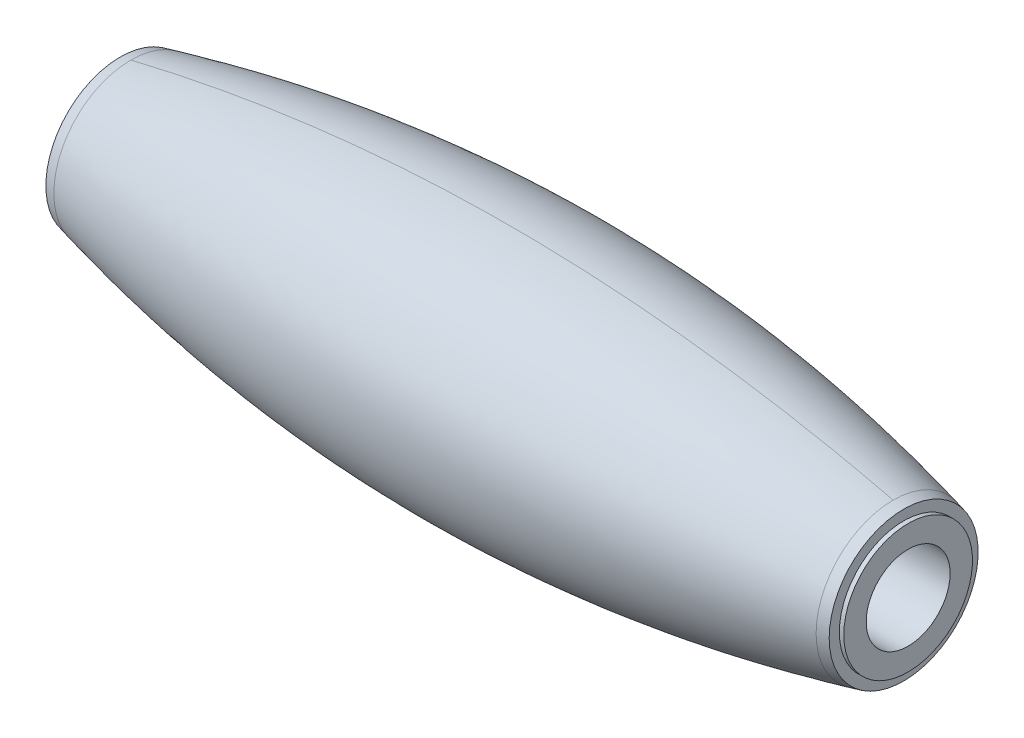
ISO-10303-21;
HEADER;
FILE_DESCRIPTION(('STEP AP214'),'2;1');
FILE_NAME('part.step','',(''),(''),'','','');
FILE_SCHEMA(('AUTOMOTIVE_DESIGN { 1 0 10303 214 1 1 1 1 }'));
ENDSEC;
DATA;
#1=APPLICATION_CONTEXT('core data for automotive mechanical design processes');
#2=APPLICATION_PROTOCOL_DEFINITION('international standard','automotive_design',2000,#1);
#3=PRODUCT_CONTEXT('',#1,'mechanical');
#4=PRODUCT('Part','Part','',(#3));
#5=PRODUCT_RELATED_PRODUCT_CATEGORY('part','',(#4));
#6=PRODUCT_DEFINITION_FORMATION('','',#4);
#7=PRODUCT_DEFINITION_CONTEXT('part definition',#1,'design');
#8=PRODUCT_DEFINITION('design','',#6,#7);
#9=PRODUCT_DEFINITION_SHAPE('','',#8);
#10=(LENGTH_UNIT() NAMED_UNIT(*) SI_UNIT(.MILLI.,.METRE.));
#11=(NAMED_UNIT(*) PLANE_ANGLE_UNIT() SI_UNIT($,.RADIAN.));
#12=(NAMED_UNIT(*) SI_UNIT($,.STERADIAN.) SOLID_ANGLE_UNIT());
#13=UNCERTAINTY_MEASURE_WITH_UNIT(LENGTH_MEASURE(1.E-05),#10,'distance_accuracy_value','');
#14=(GEOMETRIC_REPRESENTATION_CONTEXT(3) GLOBAL_UNCERTAINTY_ASSIGNED_CONTEXT((#13)) GLOBAL_UNIT_ASSIGNED_CONTEXT((#10,
#11,#12)) REPRESENTATION_CONTEXT('',''));
#15=CARTESIAN_POINT('',(0.,0.,0.));
#16=DIRECTION('',(0.,0.,1.));
#17=DIRECTION('',(1.,0.,0.));
#18=AXIS2_PLACEMENT_3D('',#15,#16,#17);
#19=CARTESIAN_POINT('',(0.,0.,0.));
#20=DIRECTION('',(1.,0.,0.));
#21=DIRECTION('',(0.,0.,-1.));
#22=AXIS2_PLACEMENT_3D('',#19,#20,#21);
#23=CYLINDRICAL_SURFACE('',#22,2.38125);
#24=CARTESIAN_POINT('',(22.479,0.,0.));
#25=DIRECTION('',(1.,0.,0.));
#26=DIRECTION('',(0.,0.,-1.));
#27=AXIS2_PLACEMENT_3D('',#24,#25,#26);
#28=CIRCLE('',#27,2.38125);
#29=CARTESIAN_POINT('',(22.479,0.,-2.38125));
#30=VERTEX_POINT('',#29);
#31=EDGE_CURVE('E86',#30,#30,#28,.F.);
#32=ORIENTED_EDGE('',*,*,#31,.F.);
#33=EDGE_LOOP('',(#32));
#34=FACE_BOUND('',#33,.T.);
#35=CARTESIAN_POINT('',(-22.4790000000034,0.,0.));
#36=DIRECTION('',(1.,0.,0.));
#37=DIRECTION('',(0.,0.,-1.));
#38=AXIS2_PLACEMENT_3D('',#35,#36,#37);
#39=CIRCLE('',#38,2.38125);
#40=CARTESIAN_POINT('',(-22.4790000000034,0.,-2.38125));
#41=VERTEX_POINT('',#40);
#42=EDGE_CURVE('E20',#41,#41,#39,.T.);
#43=ORIENTED_EDGE('',*,*,#42,.F.);
#44=EDGE_LOOP('',(#43));
#45=FACE_BOUND('',#44,.T.);
#46=ADVANCED_FACE('F17',(#34,#45),#23,.F.);
#47=CARTESIAN_POINT('',(-22.4790000000034,0.,0.));
#48=DIRECTION('',(-1.,0.,0.));
#49=DIRECTION('',(0.,0.,1.));
#50=AXIS2_PLACEMENT_3D('',#47,#48,#49);
#51=PLANE('',#50);
#52=ORIENTED_EDGE('',*,*,#42,.T.);
#53=EDGE_LOOP('',(#52));
#54=FACE_BOUND('',#53,.T.);
#55=CARTESIAN_POINT('',(-22.4790000000034,0.,0.));
#56=DIRECTION('',(1.,0.,0.));
#57=DIRECTION('',(0.,0.,-1.));
#58=AXIS2_PLACEMENT_3D('',#55,#56,#57);
#59=CIRCLE('',#58,3.65125);
#60=CARTESIAN_POINT('',(-22.4790000000034,0.,-3.65125));
#61=VERTEX_POINT('',#60);
#62=EDGE_CURVE('E84',#61,#61,#59,.T.);
#63=ORIENTED_EDGE('',*,*,#62,.F.);
#64=EDGE_LOOP('',(#63));
#65=FACE_BOUND('',#64,.T.);
#66=ADVANCED_FACE('F93',(#54,#65),#51,.T.);
#67=CARTESIAN_POINT('',(22.479,0.,0.));
#68=DIRECTION('',(1.,0.,0.));
#69=DIRECTION('',(0.,0.,-1.));
#70=AXIS2_PLACEMENT_3D('',#67,#68,#69);
#71=PLANE('',#70);
#72=ORIENTED_EDGE('',*,*,#31,.T.);
#73=EDGE_LOOP('',(#72));
#74=FACE_BOUND('',#73,.T.);
#75=CARTESIAN_POINT('',(22.479,0.,0.));
#76=DIRECTION('',(-1.,0.,0.));
#77=DIRECTION('',(0.,0.,1.));
#78=AXIS2_PLACEMENT_3D('',#75,#76,#77);
#79=CIRCLE('',#78,3.65125);
#80=CARTESIAN_POINT('',(22.479,0.,3.65125));
#81=VERTEX_POINT('',#80);
#82=EDGE_CURVE('E81',#81,#81,#79,.T.);
#83=ORIENTED_EDGE('',*,*,#82,.F.);
#84=EDGE_LOOP('',(#83));
#85=FACE_BOUND('',#84,.T.);
#86=ADVANCED_FACE('F102',(#74,#85),#71,.T.);
#87=CARTESIAN_POINT('',(-22.4790000000034,0.,0.));
#88=DIRECTION('',(1.,0.,0.));
#89=DIRECTION('',(0.,0.,-1.));
#90=AXIS2_PLACEMENT_3D('',#87,#88,#89);
#91=CYLINDRICAL_SURFACE('',#90,3.65125);
#92=CARTESIAN_POINT('',(-22.2250000000034,0.,0.));
#93=DIRECTION('',(1.,0.,0.));
#94=DIRECTION('',(0.,0.,-1.));
#95=AXIS2_PLACEMENT_3D('',#92,#93,#94);
#96=CIRCLE('',#95,3.65125);
#97=CARTESIAN_POINT('',(-22.2250000000034,0.,-3.65125));
#98=VERTEX_POINT('',#97);
#99=EDGE_CURVE('E78',#98,#98,#96,.T.);
#100=ORIENTED_EDGE('',*,*,#99,.F.);
#101=EDGE_LOOP('',(#100));
#102=FACE_BOUND('',#101,.T.);
#103=ORIENTED_EDGE('',*,*,#62,.T.);
#104=EDGE_LOOP('',(#103));
#105=FACE_BOUND('',#104,.T.);
#106=ADVANCED_FACE('F141',(#102,#105),#91,.T.);
#107=CARTESIAN_POINT('',(22.479,0.,0.));
#108=DIRECTION('',(-1.,0.,0.));
#109=DIRECTION('',(0.,0.,1.));
#110=AXIS2_PLACEMENT_3D('',#107,#108,#109);
#111=CYLINDRICAL_SURFACE('',#110,3.65125);
#112=CARTESIAN_POINT('',(22.225,0.,0.));
#113=DIRECTION('',(-1.,0.,0.));
#114=DIRECTION('',(0.,0.,1.));
#115=AXIS2_PLACEMENT_3D('',#112,#113,#114);
#116=CIRCLE('',#115,3.65125);
#117=CARTESIAN_POINT('',(22.225,0.,3.65125));
#118=VERTEX_POINT('',#117);
#119=EDGE_CURVE('E75',#118,#118,#116,.T.);
#120=ORIENTED_EDGE('',*,*,#119,.F.);
#121=EDGE_LOOP('',(#120));
#122=FACE_BOUND('',#121,.T.);
#123=ORIENTED_EDGE('',*,*,#82,.T.);
#124=EDGE_LOOP('',(#123));
#125=FACE_BOUND('',#124,.T.);
#126=ADVANCED_FACE('F137',(#122,#125),#111,.T.);
#127=CARTESIAN_POINT('',(-22.2250000000034,2.38125,0.));
#128=DIRECTION('',(-1.,0.,0.));
#129=DIRECTION('',(0.,0.,1.));
#130=AXIS2_PLACEMENT_3D('',#127,#128,#129);
#131=PLANE('',#130);
#132=ORIENTED_EDGE('',*,*,#99,.T.);
#133=EDGE_LOOP('',(#132));
#134=FACE_BOUND('',#133,.T.);
#135=CARTESIAN_POINT('',(-22.2249999999917,0.,0.));
#136=DIRECTION('',(1.,0.,0.));
#137=DIRECTION('',(0.,0.,-1.));
#138=AXIS2_PLACEMENT_3D('',#135,#136,#137);
#139=CIRCLE('',#138,4.22655856244964);
#140=CARTESIAN_POINT('',(-22.2249999999917,0.,-4.22655856244964));
#141=VERTEX_POINT('',#140);
#142=EDGE_CURVE('E72',#141,#141,#139,.T.);
#143=ORIENTED_EDGE('',*,*,#142,.F.);
#144=EDGE_LOOP('',(#143));
#145=FACE_BOUND('',#144,.T.);
#146=ADVANCED_FACE('F133',(#134,#145),#131,.T.);
#147=CARTESIAN_POINT('',(22.225,2.38125,0.));
#148=DIRECTION('',(1.,0.,0.));
#149=DIRECTION('',(0.,0.,-1.));
#150=AXIS2_PLACEMENT_3D('',#147,#148,#149);
#151=PLANE('',#150);
#152=ORIENTED_EDGE('',*,*,#119,.T.);
#153=EDGE_LOOP('',(#152));
#154=FACE_BOUND('',#153,.T.);
#155=CARTESIAN_POINT('',(22.2250000000486,0.,0.));
#156=DIRECTION('',(-1.,0.,0.));
#157=DIRECTION('',(0.,0.,1.));
#158=AXIS2_PLACEMENT_3D('',#155,#156,#157);
#159=CIRCLE('',#158,4.22655856246385);
#160=CARTESIAN_POINT('',(22.2250000000486,0.,4.22655856246385));
#161=VERTEX_POINT('',#160);
#162=EDGE_CURVE('E48',#161,#161,#159,.T.);
#163=ORIENTED_EDGE('',*,*,#162,.F.);
#164=EDGE_LOOP('',(#163));
#165=FACE_BOUND('',#164,.T.);
#166=ADVANCED_FACE('F129',(#154,#165),#151,.T.);
#167=CARTESIAN_POINT('',(-21.6280284818708,0.,0.));
#168=DIRECTION('',(1.,0.,0.));
#169=DIRECTION('',(0.,0.,-1.));
#170=AXIS2_PLACEMENT_3D('',#167,#168,#169);
#171=CONICAL_SURFACE('',#170,4.37090708773269,0.237247536257771);
#172=ORIENTED_EDGE('',*,*,#142,.T.);
#173=EDGE_LOOP('',(#172));
#174=FACE_BOUND('',#173,.T.);
#175=CARTESIAN_POINT('',(-21.6280284816593,0.,0.));
#176=DIRECTION('',(1.,0.,0.));
#177=DIRECTION('',(0.,0.,-1.));
#178=AXIS2_PLACEMENT_3D('',#175,#176,#177);
#179=CIRCLE('',#178,4.37090708779612);
#180=CARTESIAN_POINT('',(-21.6280284818708,-4.37090708773269,0.));
#181=VERTEX_POINT('',#180);
#182=CARTESIAN_POINT('',(-21.6280284816901,4.37090708779118,0.));
#183=VERTEX_POINT('',#182);
#184=EDGE_CURVE('E55',#181,#183,#179,.T.);
#185=ORIENTED_EDGE('',*,*,#184,.F.);
#186=CARTESIAN_POINT('',(-21.6280284816593,0.,0.));
#187=DIRECTION('',(1.,0.,0.));
#188=DIRECTION('',(0.,0.,-1.));
#189=AXIS2_PLACEMENT_3D('',#186,#187,#188);
#190=CIRCLE('',#189,4.37090708779612);
#191=EDGE_CURVE('E41',#183,#181,#190,.T.);
#192=ORIENTED_EDGE('',*,*,#191,.F.);
#193=EDGE_LOOP('',(#185,#192));
#194=FACE_BOUND('',#193,.T.);
#195=ADVANCED_FACE('F121',(#174,#194),#171,.T.);
#196=CARTESIAN_POINT('',(-21.6280284816593,-4.37090708779611,0.));
#197=CARTESIAN_POINT('',(-21.6280284816593,-4.37090708779611,8.74181417559223));
#198=CARTESIAN_POINT('',(-21.6280284816593,4.37090708779612,8.74181417559223));
#199=CARTESIAN_POINT('',(-21.6280284816593,4.37090708779612,0.));
#200=CARTESIAN_POINT('',(-18.090494464724,-5.22628762606418,0.));
#201=CARTESIAN_POINT('',(-18.090494464724,-5.22628762606418,10.4525752521284));
#202=CARTESIAN_POINT('',(-18.090494464724,5.22628762606418,10.4525752521284));
#203=CARTESIAN_POINT('',(-18.090494464724,5.22628762606419,0.));
#204=CARTESIAN_POINT('',(-10.9078349316213,-6.54056481136885,0.));
#205=CARTESIAN_POINT('',(-10.9078349316213,-6.54056481136885,13.0811296227377));
#206=CARTESIAN_POINT('',(-10.9078349316213,6.54056481136885,13.0811296227377));
#207=CARTESIAN_POINT('',(-10.9078349316213,6.54056481136885,0.));
#208=CARTESIAN_POINT('',(-3.44932167639718E-12,-7.20721759431536,0.));
#209=CARTESIAN_POINT('',(-3.44932167639718E-12,-7.20721759431537,14.4144351886307));
#210=CARTESIAN_POINT('',(-3.4481965893729E-12,7.20721759431536,14.4144351886307));
#211=CARTESIAN_POINT('',(-3.4481965893729E-12,7.20721759431536,0.));
#212=CARTESIAN_POINT('',(10.9078349316145,-6.54056481136969,0.));
#213=CARTESIAN_POINT('',(10.9078349316145,-6.54056481136969,13.0811296227394));
#214=CARTESIAN_POINT('',(10.9078349316145,6.54056481136969,13.0811296227394));
#215=CARTESIAN_POINT('',(10.9078349316145,6.54056481136969,0.));
#216=CARTESIAN_POINT('',(18.0904944647173,-5.22628762606555,0.));
#217=CARTESIAN_POINT('',(18.0904944647173,-5.22628762606555,10.4525752521311));
#218=CARTESIAN_POINT('',(18.0904944647173,5.22628762606554,10.4525752521311));
#219=CARTESIAN_POINT('',(18.0904944647173,5.22628762606555,0.));
#220=CARTESIAN_POINT('',(21.6280284816526,-4.37090708779774,0.));
#221=CARTESIAN_POINT('',(21.6280284816526,-4.37090708779774,8.74181417559548));
#222=CARTESIAN_POINT('',(21.6280284816526,4.37090708779774,8.74181417559548));
#223=CARTESIAN_POINT('',(21.6280284816526,4.37090708779774,0.));
#224=(BOUNDED_SURFACE() B_SPLINE_SURFACE(3,3,((#196,#197,#198,#199),(#200,#201,#202,#203),(#204,
#205,#206,#207),(#208,#209,#210,#211),(#212,#213,#214,#215),(#216,#217,#218,#219),(#220,#221,
#222,#223)),.UNSPECIFIED.,.F.,.F.,.F.) B_SPLINE_SURFACE_WITH_KNOTS((4,1,1,1,4),(4,4),
(0.18506105588484,0.342530527942445,0.50000000000005,0.657469472057654,0.814938944115259),(0.,
1.),.UNSPECIFIED.) GEOMETRIC_REPRESENTATION_ITEM() RATIONAL_B_SPLINE_SURFACE(((1.,
0.333333333333333,0.333333333333333,1.),(1.,0.333333333333333,0.333333333333333,1.),(1.,
0.333333333333333,0.333333333333333,1.),(1.,0.333333333333333,0.333333333333333,1.),(1.,
0.333333333333333,0.333333333333333,1.),(1.,0.333333333333333,0.333333333333333,1.),(1.,
0.333333333333333,0.333333333333333,1.))) REPRESENTATION_ITEM('') SURFACE());
#225=CARTESIAN_POINT('',(21.6280284816526,0.,0.));
#226=DIRECTION('',(-1.,0.,0.));
#227=DIRECTION('',(0.,0.,1.));
#228=AXIS2_PLACEMENT_3D('',#225,#226,#227);
#229=CIRCLE('',#228,4.37090708779774);
#230=CARTESIAN_POINT('',(21.6280284817333,-4.37090708778653,0.));
#231=VERTEX_POINT('',#230);
#232=CARTESIAN_POINT('',(21.6280284817064,4.37090708779027,0.));
#233=VERTEX_POINT('',#232);
#234=EDGE_CURVE('E33',#231,#233,#229,.T.);
#235=CARTESIAN_POINT('',(-21.6280284816593,4.37090708779612,0.));
#236=CARTESIAN_POINT('',(-18.090494464724,5.22628762606419,0.));
#237=CARTESIAN_POINT('',(-10.9078349316213,6.54056481136885,0.));
#238=CARTESIAN_POINT('',(-3.4481965893729E-12,7.20721759431536,0.));
#239=CARTESIAN_POINT('',(10.9078349316145,6.54056481136969,0.));
#240=CARTESIAN_POINT('',(18.0904944647173,5.22628762606555,0.));
#241=CARTESIAN_POINT('',(21.6280284816526,4.37090708779774,0.));
#242=B_SPLINE_CURVE_WITH_KNOTS('',3,(#235,#236,#237,#238,#239,#240,#241),.UNSPECIFIED.,.F.,.F.,
(4,1,1,1,4),(0.18506105588484,0.342530527942445,0.50000000000005,0.657469472057654,
0.814938944115259),.UNSPECIFIED.);
#243=EDGE_CURVE('E25',#183,#233,#242,.T.);
#244=CARTESIAN_POINT('',(-21.6280284816593,-4.37090708779611,0.));
#245=CARTESIAN_POINT('',(-18.090494464724,-5.22628762606418,0.));
#246=CARTESIAN_POINT('',(-10.9078349316213,-6.54056481136885,0.));
#247=CARTESIAN_POINT('',(-3.44932167639718E-12,-7.20721759431536,0.));
#248=CARTESIAN_POINT('',(10.9078349316145,-6.54056481136969,0.));
#249=CARTESIAN_POINT('',(18.0904944647173,-5.22628762606555,0.));
#250=CARTESIAN_POINT('',(21.6280284816526,-4.37090708779774,0.));
#251=B_SPLINE_CURVE_WITH_KNOTS('',3,(#244,#245,#246,#247,#248,#249,#250),.UNSPECIFIED.,.F.,.F.,
(4,1,1,1,4),(0.18506105588484,0.342530527942445,0.50000000000005,0.657469472057654,
0.814938944115259),.UNSPECIFIED.);
#252=EDGE_CURVE('E51',#231,#181,#251,.F.);
#253=ORIENTED_EDGE('',*,*,#234,.T.);
#254=ORIENTED_EDGE('',*,*,#243,.F.);
#255=ORIENTED_EDGE('',*,*,#191,.T.);
#256=ORIENTED_EDGE('',*,*,#252,.F.);
#257=EDGE_LOOP('',(#253,#254,#255,#256));
#258=FACE_BOUND('',#257,.T.);
#259=ADVANCED_FACE('F52',(#258),#224,.T.);
#260=CARTESIAN_POINT('',(21.628028481814,0.,0.));
#261=DIRECTION('',(-1.,0.,0.));
#262=DIRECTION('',(0.,0.,1.));
#263=AXIS2_PLACEMENT_3D('',#260,#261,#262);
#264=CONICAL_SURFACE('',#263,4.37090708777532,0.237247536259246);
#265=CARTESIAN_POINT('',(21.6280284816526,0.,0.));
#266=DIRECTION('',(-1.,0.,0.));
#267=DIRECTION('',(0.,0.,1.));
#268=AXIS2_PLACEMENT_3D('',#265,#266,#267);
#269=CIRCLE('',#268,4.37090708779774);
#270=EDGE_CURVE('E11',#233,#231,#269,.T.);
#271=ORIENTED_EDGE('',*,*,#270,.F.);
#272=ORIENTED_EDGE('',*,*,#234,.F.);
#273=EDGE_LOOP('',(#271,#272));
#274=FACE_BOUND('',#273,.T.);
#275=ORIENTED_EDGE('',*,*,#162,.T.);
#276=EDGE_LOOP('',(#275));
#277=FACE_BOUND('',#276,.T.);
#278=ADVANCED_FACE('F45',(#274,#277),#264,.T.);
#279=CARTESIAN_POINT('',(-21.6280284816593,4.37090708779612,0.));
#280=CARTESIAN_POINT('',(-21.6280284816593,4.37090708779612,-8.74181417559223));
#281=CARTESIAN_POINT('',(-21.6280284816593,-4.37090708779611,-8.74181417559223));
#282=CARTESIAN_POINT('',(-21.6280284816593,-4.37090708779611,0.));
#283=CARTESIAN_POINT('',(-18.090494464724,5.22628762606419,0.));
#284=CARTESIAN_POINT('',(-18.090494464724,5.22628762606419,-10.4525752521284));
#285=CARTESIAN_POINT('',(-18.090494464724,-5.22628762606418,-10.4525752521284));
#286=CARTESIAN_POINT('',(-18.090494464724,-5.22628762606418,0.));
#287=CARTESIAN_POINT('',(-10.9078349316213,6.54056481136885,0.));
#288=CARTESIAN_POINT('',(-10.9078349316213,6.54056481136885,-13.0811296227377));
#289=CARTESIAN_POINT('',(-10.9078349316213,-6.54056481136884,-13.0811296227377));
#290=CARTESIAN_POINT('',(-10.9078349316213,-6.54056481136885,0.));
#291=CARTESIAN_POINT('',(-3.4481965893729E-12,7.20721759431536,0.));
#292=CARTESIAN_POINT('',(-3.4481965893729E-12,7.20721759431537,-14.4144351886307));
#293=CARTESIAN_POINT('',(-3.44932167639718E-12,-7.20721759431536,-14.4144351886307));
#294=CARTESIAN_POINT('',(-3.44932167639718E-12,-7.20721759431536,0.));
#295=CARTESIAN_POINT('',(10.9078349316145,6.54056481136969,0.));
#296=CARTESIAN_POINT('',(10.9078349316145,6.54056481136969,-13.0811296227394));
#297=CARTESIAN_POINT('',(10.9078349316145,-6.54056481136969,-13.0811296227394));
#298=CARTESIAN_POINT('',(10.9078349316145,-6.54056481136969,0.));
#299=CARTESIAN_POINT('',(18.0904944647173,5.22628762606555,0.));
#300=CARTESIAN_POINT('',(18.0904944647173,5.22628762606555,-10.4525752521311));
#301=CARTESIAN_POINT('',(18.0904944647173,-5.22628762606555,-10.4525752521311));
#302=CARTESIAN_POINT('',(18.0904944647173,-5.22628762606555,0.));
#303=CARTESIAN_POINT('',(21.6280284816526,4.37090708779774,0.));
#304=CARTESIAN_POINT('',(21.6280284816526,4.37090708779774,-8.74181417559548));
#305=CARTESIAN_POINT('',(21.6280284816526,-4.37090708779774,-8.74181417559548));
#306=CARTESIAN_POINT('',(21.6280284816526,-4.37090708779774,0.));
#307=(BOUNDED_SURFACE() B_SPLINE_SURFACE(3,3,((#279,#280,#281,#282),(#283,#284,#285,#286),(#287,
#288,#289,#290),(#291,#292,#293,#294),(#295,#296,#297,#298),(#299,#300,#301,#302),(#303,#304,
#305,#306)),.UNSPECIFIED.,.F.,.F.,.F.) B_SPLINE_SURFACE_WITH_KNOTS((4,1,1,1,4),(4,4),
(0.18506105588484,0.342530527942445,0.50000000000005,0.657469472057654,0.814938944115259),(0.,
1.),.UNSPECIFIED.) GEOMETRIC_REPRESENTATION_ITEM() RATIONAL_B_SPLINE_SURFACE(((1.,
0.333333333333333,0.333333333333333,1.),(1.,0.333333333333333,0.333333333333333,1.),(1.,
0.333333333333333,0.333333333333333,1.),(1.,0.333333333333333,0.333333333333333,1.),(1.,
0.333333333333333,0.333333333333333,1.),(1.,0.333333333333333,0.333333333333333,1.),(1.,
0.333333333333333,0.333333333333333,1.))) REPRESENTATION_ITEM('') SURFACE());
#308=ORIENTED_EDGE('',*,*,#243,.T.);
#309=ORIENTED_EDGE('',*,*,#270,.T.);
#310=ORIENTED_EDGE('',*,*,#252,.T.);
#311=ORIENTED_EDGE('',*,*,#184,.T.);
#312=EDGE_LOOP('',(#308,#309,#310,#311));
#313=FACE_BOUND('',#312,.T.);
#314=ADVANCED_FACE('F57',(#313),#307,.T.);
#315=CLOSED_SHELL('',(#46,#66,#86,#106,#126,#146,#166,#195,#259,#278,#314));
#316=MANIFOLD_SOLID_BREP('B1',#315);
#317=ADVANCED_BREP_SHAPE_REPRESENTATION('',(#18,#316),#14);
#318=SHAPE_DEFINITION_REPRESENTATION(#9,#317);
ENDSEC;
END-ISO-10303-21;
